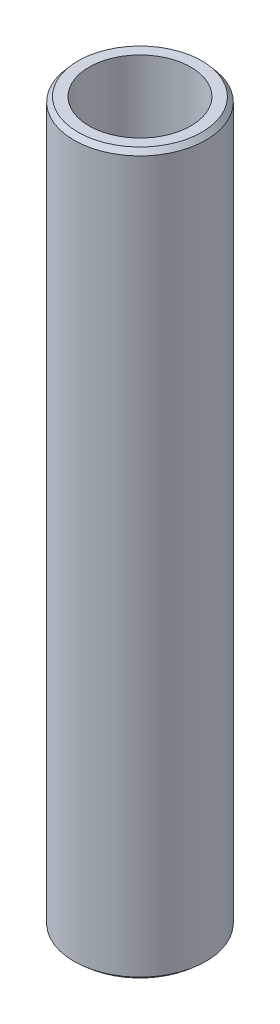
ISO-10303-21;
HEADER;
FILE_DESCRIPTION(('STEP AP214'),'2;1');
FILE_NAME('part.step','',(''),(''),'','','');
FILE_SCHEMA(('AUTOMOTIVE_DESIGN { 1 0 10303 214 1 1 1 1 }'));
ENDSEC;
DATA;
#1=APPLICATION_CONTEXT('core data for automotive mechanical design processes');
#2=APPLICATION_PROTOCOL_DEFINITION('international standard','automotive_design',2000,#1);
#3=PRODUCT_CONTEXT('',#1,'mechanical');
#4=PRODUCT('Part','Part','',(#3));
#5=PRODUCT_RELATED_PRODUCT_CATEGORY('part','',(#4));
#6=PRODUCT_DEFINITION_FORMATION('','',#4);
#7=PRODUCT_DEFINITION_CONTEXT('part definition',#1,'design');
#8=PRODUCT_DEFINITION('design','',#6,#7);
#9=PRODUCT_DEFINITION_SHAPE('','',#8);
#10=(LENGTH_UNIT() NAMED_UNIT(*) SI_UNIT(.MILLI.,.METRE.));
#11=(NAMED_UNIT(*) PLANE_ANGLE_UNIT() SI_UNIT($,.RADIAN.));
#12=(NAMED_UNIT(*) SI_UNIT($,.STERADIAN.) SOLID_ANGLE_UNIT());
#13=UNCERTAINTY_MEASURE_WITH_UNIT(LENGTH_MEASURE(1.E-05),#10,'distance_accuracy_value','');
#14=(GEOMETRIC_REPRESENTATION_CONTEXT(3) GLOBAL_UNCERTAINTY_ASSIGNED_CONTEXT((#13)) GLOBAL_UNIT_ASSIGNED_CONTEXT((#10,
#11,#12)) REPRESENTATION_CONTEXT('',''));
#15=CARTESIAN_POINT('',(0.,0.,0.));
#16=DIRECTION('',(0.,0.,1.));
#17=DIRECTION('',(1.,0.,0.));
#18=AXIS2_PLACEMENT_3D('',#15,#16,#17);
#19=CARTESIAN_POINT('',(0.,600.,0.));
#20=DIRECTION('',(0.,-1.,0.));
#21=DIRECTION('',(0.,0.,-1.));
#22=AXIS2_PLACEMENT_3D('',#19,#20,#21);
#23=CYLINDRICAL_SURFACE('',#22,55.);
#24=CARTESIAN_POINT('',(0.,596.007884761227,0.));
#25=DIRECTION('',(0.,1.,0.));
#26=DIRECTION('',(0.,0.,1.));
#27=AXIS2_PLACEMENT_3D('',#24,#25,#26);
#28=CIRCLE('',#27,55.);
#29=CARTESIAN_POINT('',(0.,596.007884761227,55.));
#30=VERTEX_POINT('',#29);
#31=EDGE_CURVE('E50',#30,#30,#28,.F.);
#32=ORIENTED_EDGE('',*,*,#31,.T.);
#33=EDGE_LOOP('',(#32));
#34=FACE_BOUND('',#33,.T.);
#35=CARTESIAN_POINT('',(0.,3.45294011272568,0.));
#36=DIRECTION('',(0.,1.,0.));
#37=DIRECTION('',(0.,0.,1.));
#38=AXIS2_PLACEMENT_3D('',#35,#36,#37);
#39=CIRCLE('',#38,55.);
#40=CARTESIAN_POINT('',(0.,3.45294011272568,55.));
#41=VERTEX_POINT('',#40);
#42=EDGE_CURVE('E51',#41,#41,#39,.T.);
#43=ORIENTED_EDGE('',*,*,#42,.T.);
#44=EDGE_LOOP('',(#43));
#45=FACE_BOUND('',#44,.T.);
#46=ADVANCED_FACE('F39',(#34,#45),#23,.T.);
#47=CARTESIAN_POINT('',(0.,600.,0.));
#48=DIRECTION('',(0.,1.,0.));
#49=DIRECTION('',(0.,0.,1.));
#50=AXIS2_PLACEMENT_3D('',#47,#48,#49);
#51=PLANE('',#50);
#52=CARTESIAN_POINT('',(0.,600.,0.));
#53=DIRECTION('',(0.,1.,0.));
#54=DIRECTION('',(0.,0.,1.));
#55=AXIS2_PLACEMENT_3D('',#52,#53,#54);
#56=CIRCLE('',#55,51.5470598872744);
#57=CARTESIAN_POINT('',(0.,600.,51.5470598872744));
#58=VERTEX_POINT('',#57);
#59=EDGE_CURVE('E54',#58,#58,#56,.T.);
#60=ORIENTED_EDGE('',*,*,#59,.T.);
#61=EDGE_LOOP('',(#60));
#62=FACE_BOUND('',#61,.T.);
#63=CARTESIAN_POINT('',(0.,600.,0.));
#64=DIRECTION('',(0.,1.,0.));
#65=DIRECTION('',(0.,0.,1.));
#66=AXIS2_PLACEMENT_3D('',#63,#64,#65);
#67=CIRCLE('',#66,42.4289296689826);
#68=CARTESIAN_POINT('',(0.,600.,42.4289296689826));
#69=VERTEX_POINT('',#68);
#70=EDGE_CURVE('E58',#69,#69,#67,.T.);
#71=ORIENTED_EDGE('',*,*,#70,.F.);
#72=EDGE_LOOP('',(#71));
#73=FACE_BOUND('',#72,.T.);
#74=ADVANCED_FACE('F69',(#62,#73),#51,.T.);
#75=CARTESIAN_POINT('',(0.,0.,0.));
#76=DIRECTION('',(0.,1.,0.));
#77=DIRECTION('',(0.,0.,1.));
#78=AXIS2_PLACEMENT_3D('',#75,#76,#77);
#79=PLANE('',#78);
#80=CARTESIAN_POINT('',(0.,0.,0.));
#81=DIRECTION('',(0.,1.,0.));
#82=DIRECTION('',(0.,0.,1.));
#83=AXIS2_PLACEMENT_3D('',#80,#81,#82);
#84=CIRCLE('',#83,51.007884761227);
#85=CARTESIAN_POINT('',(0.,0.,51.007884761227));
#86=VERTEX_POINT('',#85);
#87=EDGE_CURVE('E10',#86,#86,#84,.F.);
#88=ORIENTED_EDGE('',*,*,#87,.T.);
#89=EDGE_LOOP('',(#88));
#90=FACE_BOUND('',#89,.T.);
#91=CARTESIAN_POINT('',(0.,0.,0.));
#92=DIRECTION('',(0.,1.,0.));
#93=DIRECTION('',(0.,0.,1.));
#94=AXIS2_PLACEMENT_3D('',#91,#92,#93);
#95=CIRCLE('',#94,42.4289296689826);
#96=CARTESIAN_POINT('',(0.,0.,42.4289296689826));
#97=VERTEX_POINT('',#96);
#98=EDGE_CURVE('E63',#97,#97,#95,.T.);
#99=ORIENTED_EDGE('',*,*,#98,.T.);
#100=EDGE_LOOP('',(#99));
#101=FACE_BOUND('',#100,.T.);
#102=ADVANCED_FACE('F75',(#90,#101),#79,.F.);
#103=CARTESIAN_POINT('',(0.,600.,0.));
#104=DIRECTION('',(0.,-1.,0.));
#105=DIRECTION('',(0.,0.,-1.));
#106=AXIS2_PLACEMENT_3D('',#103,#104,#105);
#107=CYLINDRICAL_SURFACE('',#106,42.4289296689826);
#108=ORIENTED_EDGE('',*,*,#70,.T.);
#109=EDGE_LOOP('',(#108));
#110=FACE_BOUND('',#109,.T.);
#111=ORIENTED_EDGE('',*,*,#98,.F.);
#112=EDGE_LOOP('',(#111));
#113=FACE_BOUND('',#112,.T.);
#114=ADVANCED_FACE('F70',(#110,#113),#107,.F.);
#115=CARTESIAN_POINT('',(0.,600.,0.));
#116=DIRECTION('',(0.,-1.,0.));
#117=DIRECTION('',(0.,0.,-1.));
#118=AXIS2_PLACEMENT_3D('',#115,#116,#117);
#119=CONICAL_SURFACE('',#118,51.5470598872744,0.713103808959638);
#120=ORIENTED_EDGE('',*,*,#31,.F.);
#121=EDGE_LOOP('',(#120));
#122=FACE_BOUND('',#121,.T.);
#123=ORIENTED_EDGE('',*,*,#59,.F.);
#124=EDGE_LOOP('',(#123));
#125=FACE_BOUND('',#124,.T.);
#126=ADVANCED_FACE('F81',(#122,#125),#119,.T.);
#127=CARTESIAN_POINT('',(0.,3.45294011272568,0.));
#128=DIRECTION('',(0.,1.,0.));
#129=DIRECTION('',(0.,0.,1.));
#130=AXIS2_PLACEMENT_3D('',#127,#128,#129);
#131=CONICAL_SURFACE('',#130,55.,0.857692517835253);
#132=ORIENTED_EDGE('',*,*,#87,.F.);
#133=EDGE_LOOP('',(#132));
#134=FACE_BOUND('',#133,.T.);
#135=ORIENTED_EDGE('',*,*,#42,.F.);
#136=EDGE_LOOP('',(#135));
#137=FACE_BOUND('',#136,.T.);
#138=ADVANCED_FACE('F45',(#134,#137),#131,.T.);
#139=CLOSED_SHELL('',(#46,#74,#102,#114,#126,#138));
#140=MANIFOLD_SOLID_BREP('B2',#139);
#141=ADVANCED_BREP_SHAPE_REPRESENTATION('',(#18,#140),#14);
#142=SHAPE_DEFINITION_REPRESENTATION(#9,#141);
ENDSEC;
END-ISO-10303-21;
